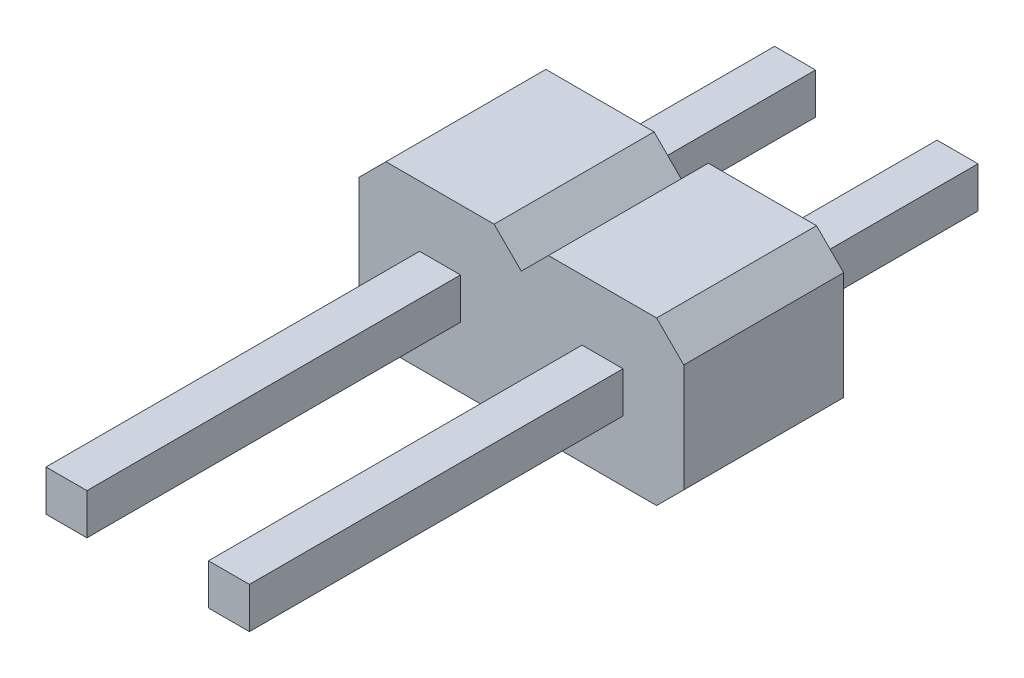
ISO-10303-21;
HEADER;
FILE_DESCRIPTION(('STEP AP214'),'2;1');
FILE_NAME('part.step','',(''),(''),'','','');
FILE_SCHEMA(('AUTOMOTIVE_DESIGN { 1 0 10303 214 1 1 1 1 }'));
ENDSEC;
DATA;
#1=APPLICATION_CONTEXT('core data for automotive mechanical design processes');
#2=APPLICATION_PROTOCOL_DEFINITION('international standard','automotive_design',2000,#1);
#3=PRODUCT_CONTEXT('',#1,'mechanical');
#4=PRODUCT('Part','Part','',(#3));
#5=PRODUCT_RELATED_PRODUCT_CATEGORY('part','',(#4));
#6=PRODUCT_DEFINITION_FORMATION('','',#4);
#7=PRODUCT_DEFINITION_CONTEXT('part definition',#1,'design');
#8=PRODUCT_DEFINITION('design','',#6,#7);
#9=PRODUCT_DEFINITION_SHAPE('','',#8);
#10=(LENGTH_UNIT() NAMED_UNIT(*) SI_UNIT(.MILLI.,.METRE.));
#11=(NAMED_UNIT(*) PLANE_ANGLE_UNIT() SI_UNIT($,.RADIAN.));
#12=(NAMED_UNIT(*) SI_UNIT($,.STERADIAN.) SOLID_ANGLE_UNIT());
#13=UNCERTAINTY_MEASURE_WITH_UNIT(LENGTH_MEASURE(1.E-05),#10,'distance_accuracy_value','');
#14=(GEOMETRIC_REPRESENTATION_CONTEXT(3) GLOBAL_UNCERTAINTY_ASSIGNED_CONTEXT((#13)) GLOBAL_UNIT_ASSIGNED_CONTEXT((#10,
#11,#12)) REPRESENTATION_CONTEXT('',''));
#15=CARTESIAN_POINT('',(0.,0.,0.));
#16=DIRECTION('',(0.,0.,1.));
#17=DIRECTION('',(1.,0.,0.));
#18=AXIS2_PLACEMENT_3D('',#15,#16,#17);
#19=CARTESIAN_POINT('',(0.,0.,2.5));
#20=DIRECTION('',(0.,0.,-1.));
#21=DIRECTION('',(-1.,0.,0.));
#22=AXIS2_PLACEMENT_3D('',#19,#20,#21);
#23=PLANE('',#22);
#24=DIRECTION('',(0.,-1.,0.));
#25=VECTOR('',#24,1.);
#26=CARTESIAN_POINT('',(-0.32,0.32,2.5));
#27=LINE('',#26,#25);
#28=CARTESIAN_POINT('',(-0.32,0.32,2.5));
#29=VERTEX_POINT('',#28);
#30=CARTESIAN_POINT('',(-0.32,-0.32,2.5));
#31=VERTEX_POINT('',#30);
#32=EDGE_CURVE('E335',#29,#31,#27,.T.);
#33=ORIENTED_EDGE('',*,*,#32,.F.);
#34=DIRECTION('',(-1.,0.,0.));
#35=VECTOR('',#34,1.);
#36=CARTESIAN_POINT('',(-0.32,0.32,2.5));
#37=LINE('',#36,#35);
#38=CARTESIAN_POINT('',(0.32,0.32,2.5));
#39=VERTEX_POINT('',#38);
#40=EDGE_CURVE('E340',#39,#29,#37,.T.);
#41=ORIENTED_EDGE('',*,*,#40,.F.);
#42=DIRECTION('',(0.,1.,0.));
#43=VECTOR('',#42,1.);
#44=CARTESIAN_POINT('',(0.32,0.32,2.5));
#45=LINE('',#44,#43);
#46=CARTESIAN_POINT('',(0.32,-0.32,2.5));
#47=VERTEX_POINT('',#46);
#48=EDGE_CURVE('E352',#47,#39,#45,.T.);
#49=ORIENTED_EDGE('',*,*,#48,.F.);
#50=DIRECTION('',(1.,0.,0.));
#51=VECTOR('',#50,1.);
#52=CARTESIAN_POINT('',(-0.32,-0.32,2.5));
#53=LINE('',#52,#51);
#54=EDGE_CURVE('E349',#31,#47,#53,.T.);
#55=ORIENTED_EDGE('',*,*,#54,.F.);
#56=EDGE_LOOP('',(#33,#41,#49,#55));
#57=FACE_BOUND('',#56,.T.);
#58=DIRECTION('',(1.,0.,0.));
#59=VECTOR('',#58,1.);
#60=CARTESIAN_POINT('',(-0.845735931288072,-1.27,2.5));
#61=LINE('',#60,#59);
#62=CARTESIAN_POINT('',(-0.845735931288072,-1.27,2.5));
#63=VERTEX_POINT('',#62);
#64=CARTESIAN_POINT('',(0.845735931288072,-1.27,2.5));
#65=VERTEX_POINT('',#64);
#66=EDGE_CURVE('E398',#63,#65,#61,.T.);
#67=ORIENTED_EDGE('',*,*,#66,.T.);
#68=DIRECTION('',(0.707106781186547,0.707106781186548,0.));
#69=VECTOR('',#68,1.);
#70=CARTESIAN_POINT('',(0.845735931288072,-1.27,2.5));
#71=LINE('',#70,#69);
#72=CARTESIAN_POINT('',(1.27,-0.845735931288072,2.5));
#73=VERTEX_POINT('',#72);
#74=EDGE_CURVE('E401',#65,#73,#71,.T.);
#75=ORIENTED_EDGE('',*,*,#74,.T.);
#76=DIRECTION('',(0.707106781186548,-0.707106781186548,0.));
#77=VECTOR('',#76,1.);
#78=CARTESIAN_POINT('',(1.27,-0.845735931288072,2.5));
#79=LINE('',#78,#77);
#80=CARTESIAN_POINT('',(1.69426406871193,-1.27,2.5));
#81=VERTEX_POINT('',#80);
#82=EDGE_CURVE('E301',#73,#81,#79,.T.);
#83=ORIENTED_EDGE('',*,*,#82,.T.);
#84=DIRECTION('',(1.,0.,0.));
#85=VECTOR('',#84,1.);
#86=CARTESIAN_POINT('',(1.69426406871193,-1.27,2.5));
#87=LINE('',#86,#85);
#88=CARTESIAN_POINT('',(3.38573593128807,-1.27,2.5));
#89=VERTEX_POINT('',#88);
#90=EDGE_CURVE('E286',#81,#89,#87,.T.);
#91=ORIENTED_EDGE('',*,*,#90,.T.);
#92=DIRECTION('',(0.707106781186547,0.707106781186548,0.));
#93=VECTOR('',#92,1.);
#94=CARTESIAN_POINT('',(3.38573593128807,-1.27,2.5));
#95=LINE('',#94,#93);
#96=CARTESIAN_POINT('',(3.81,-0.845735931288072,2.5));
#97=VERTEX_POINT('',#96);
#98=EDGE_CURVE('E289',#89,#97,#95,.T.);
#99=ORIENTED_EDGE('',*,*,#98,.T.);
#100=DIRECTION('',(0.,1.,0.));
#101=VECTOR('',#100,1.);
#102=CARTESIAN_POINT('',(3.81,0.845735931288072,2.5));
#103=LINE('',#102,#101);
#104=CARTESIAN_POINT('',(3.81,0.845735931288072,2.5));
#105=VERTEX_POINT('',#104);
#106=EDGE_CURVE('E292',#97,#105,#103,.T.);
#107=ORIENTED_EDGE('',*,*,#106,.T.);
#108=DIRECTION('',(-0.707106781186547,0.707106781186548,0.));
#109=VECTOR('',#108,1.);
#110=CARTESIAN_POINT('',(3.81,0.845735931288072,2.5));
#111=LINE('',#110,#109);
#112=CARTESIAN_POINT('',(3.38573593128807,1.27,2.5));
#113=VERTEX_POINT('',#112);
#114=EDGE_CURVE('E294',#105,#113,#111,.T.);
#115=ORIENTED_EDGE('',*,*,#114,.T.);
#116=DIRECTION('',(-1.,0.,0.));
#117=VECTOR('',#116,1.);
#118=CARTESIAN_POINT('',(1.69426406871193,1.27,2.5));
#119=LINE('',#118,#117);
#120=CARTESIAN_POINT('',(1.69426406871193,1.27,2.5));
#121=VERTEX_POINT('',#120);
#122=EDGE_CURVE('E296',#113,#121,#119,.T.);
#123=ORIENTED_EDGE('',*,*,#122,.T.);
#124=DIRECTION('',(-0.707106781186547,-0.707106781186548,0.));
#125=VECTOR('',#124,1.);
#126=CARTESIAN_POINT('',(1.69426406871193,1.27,2.5));
#127=LINE('',#126,#125);
#128=CARTESIAN_POINT('',(1.27,0.845735931288072,2.5));
#129=VERTEX_POINT('',#128);
#130=EDGE_CURVE('E298',#121,#129,#127,.T.);
#131=ORIENTED_EDGE('',*,*,#130,.T.);
#132=DIRECTION('',(-0.707106781186547,0.707106781186548,0.));
#133=VECTOR('',#132,1.);
#134=CARTESIAN_POINT('',(1.27,0.845735931288072,2.5));
#135=LINE('',#134,#133);
#136=CARTESIAN_POINT('',(0.845735931288072,1.27,2.5));
#137=VERTEX_POINT('',#136);
#138=EDGE_CURVE('E404',#129,#137,#135,.T.);
#139=ORIENTED_EDGE('',*,*,#138,.T.);
#140=DIRECTION('',(-1.,0.,0.));
#141=VECTOR('',#140,1.);
#142=CARTESIAN_POINT('',(-0.845735931288072,1.27,2.5));
#143=LINE('',#142,#141);
#144=CARTESIAN_POINT('',(-0.845735931288072,1.27,2.5));
#145=VERTEX_POINT('',#144);
#146=EDGE_CURVE('E406',#137,#145,#143,.T.);
#147=ORIENTED_EDGE('',*,*,#146,.T.);
#148=DIRECTION('',(-0.707106781186547,-0.707106781186548,0.));
#149=VECTOR('',#148,1.);
#150=CARTESIAN_POINT('',(-0.845735931288072,1.27,2.5));
#151=LINE('',#150,#149);
#152=CARTESIAN_POINT('',(-1.27,0.845735931288072,2.5));
#153=VERTEX_POINT('',#152);
#154=EDGE_CURVE('E408',#145,#153,#151,.T.);
#155=ORIENTED_EDGE('',*,*,#154,.T.);
#156=DIRECTION('',(0.,-1.,0.));
#157=VECTOR('',#156,1.);
#158=CARTESIAN_POINT('',(-1.27,0.845735931288072,2.5));
#159=LINE('',#158,#157);
#160=CARTESIAN_POINT('',(-1.27,-0.845735931288072,2.5));
#161=VERTEX_POINT('',#160);
#162=EDGE_CURVE('E410',#153,#161,#159,.T.);
#163=ORIENTED_EDGE('',*,*,#162,.T.);
#164=DIRECTION('',(0.707106781186548,-0.707106781186548,0.));
#165=VECTOR('',#164,1.);
#166=CARTESIAN_POINT('',(-1.27,-0.845735931288072,2.5));
#167=LINE('',#166,#165);
#168=EDGE_CURVE('E412',#161,#63,#167,.T.);
#169=ORIENTED_EDGE('',*,*,#168,.T.);
#170=EDGE_LOOP('',(#67,#75,#83,#91,#99,#107,#115,#123,#131,#139,#147,#155,#163,#169));
#171=FACE_BOUND('',#170,.T.);
#172=DIRECTION('',(0.,-1.,0.));
#173=VECTOR('',#172,1.);
#174=CARTESIAN_POINT('',(2.22,0.32,2.5));
#175=LINE('',#174,#173);
#176=CARTESIAN_POINT('',(2.22,0.32,2.5));
#177=VERTEX_POINT('',#176);
#178=CARTESIAN_POINT('',(2.22,-0.32,2.5));
#179=VERTEX_POINT('',#178);
#180=EDGE_CURVE('E250',#177,#179,#175,.T.);
#181=ORIENTED_EDGE('',*,*,#180,.F.);
#182=DIRECTION('',(-1.,0.,0.));
#183=VECTOR('',#182,1.);
#184=CARTESIAN_POINT('',(2.22,0.32,2.5));
#185=LINE('',#184,#183);
#186=CARTESIAN_POINT('',(2.86,0.32,2.5));
#187=VERTEX_POINT('',#186);
#188=EDGE_CURVE('E247',#187,#177,#185,.T.);
#189=ORIENTED_EDGE('',*,*,#188,.F.);
#190=DIRECTION('',(0.,1.,0.));
#191=VECTOR('',#190,1.);
#192=CARTESIAN_POINT('',(2.86,0.32,2.5));
#193=LINE('',#192,#191);
#194=CARTESIAN_POINT('',(2.86,-0.32,2.5));
#195=VERTEX_POINT('',#194);
#196=EDGE_CURVE('E53',#195,#187,#193,.T.);
#197=ORIENTED_EDGE('',*,*,#196,.F.);
#198=DIRECTION('',(1.,0.,0.));
#199=VECTOR('',#198,1.);
#200=CARTESIAN_POINT('',(2.22,-0.32,2.5));
#201=LINE('',#200,#199);
#202=EDGE_CURVE('E48',#179,#195,#201,.T.);
#203=ORIENTED_EDGE('',*,*,#202,.F.);
#204=EDGE_LOOP('',(#181,#189,#197,#203));
#205=FACE_BOUND('',#204,.T.);
#206=ADVANCED_FACE('F33',(#57,#171,#205),#23,.F.);
#207=CARTESIAN_POINT('',(0.,0.,0.));
#208=DIRECTION('',(0.,0.,-1.));
#209=DIRECTION('',(-1.,0.,0.));
#210=AXIS2_PLACEMENT_3D('',#207,#208,#209);
#211=PLANE('',#210);
#212=DIRECTION('',(1.,0.,0.));
#213=VECTOR('',#212,1.);
#214=CARTESIAN_POINT('',(-0.32,0.32,0.));
#215=LINE('',#214,#213);
#216=CARTESIAN_POINT('',(-0.32,0.32,0.));
#217=VERTEX_POINT('',#216);
#218=CARTESIAN_POINT('',(0.32,0.32,0.));
#219=VERTEX_POINT('',#218);
#220=EDGE_CURVE('E382',#217,#219,#215,.T.);
#221=ORIENTED_EDGE('',*,*,#220,.F.);
#222=DIRECTION('',(0.,1.,0.));
#223=VECTOR('',#222,1.);
#224=CARTESIAN_POINT('',(-0.32,0.32,0.));
#225=LINE('',#224,#223);
#226=CARTESIAN_POINT('',(-0.32,-0.32,0.));
#227=VERTEX_POINT('',#226);
#228=EDGE_CURVE('E368',#227,#217,#225,.T.);
#229=ORIENTED_EDGE('',*,*,#228,.F.);
#230=DIRECTION('',(-1.,0.,0.));
#231=VECTOR('',#230,1.);
#232=CARTESIAN_POINT('',(-0.32,-0.32,0.));
#233=LINE('',#232,#231);
#234=CARTESIAN_POINT('',(0.32,-0.32,0.));
#235=VERTEX_POINT('',#234);
#236=EDGE_CURVE('E373',#235,#227,#233,.T.);
#237=ORIENTED_EDGE('',*,*,#236,.F.);
#238=DIRECTION('',(0.,-1.,0.));
#239=VECTOR('',#238,1.);
#240=CARTESIAN_POINT('',(0.32,0.32,0.));
#241=LINE('',#240,#239);
#242=EDGE_CURVE('E384',#219,#235,#241,.T.);
#243=ORIENTED_EDGE('',*,*,#242,.F.);
#244=EDGE_LOOP('',(#221,#229,#237,#243));
#245=FACE_BOUND('',#244,.T.);
#246=DIRECTION('',(1.,0.,0.));
#247=VECTOR('',#246,1.);
#248=CARTESIAN_POINT('',(-0.845735931288072,-1.27,0.));
#249=LINE('',#248,#247);
#250=CARTESIAN_POINT('',(-0.845735931288072,-1.27,0.));
#251=VERTEX_POINT('',#250);
#252=CARTESIAN_POINT('',(0.845735931288072,-1.27,0.));
#253=VERTEX_POINT('',#252);
#254=EDGE_CURVE('E397',#251,#253,#249,.T.);
#255=ORIENTED_EDGE('',*,*,#254,.F.);
#256=DIRECTION('',(0.707106781186548,-0.707106781186548,0.));
#257=VECTOR('',#256,1.);
#258=CARTESIAN_POINT('',(-1.27,-0.845735931288072,0.));
#259=LINE('',#258,#257);
#260=CARTESIAN_POINT('',(-1.27,-0.845735931288072,0.));
#261=VERTEX_POINT('',#260);
#262=EDGE_CURVE('E402',#261,#251,#259,.T.);
#263=ORIENTED_EDGE('',*,*,#262,.F.);
#264=DIRECTION('',(0.,-1.,0.));
#265=VECTOR('',#264,1.);
#266=CARTESIAN_POINT('',(-1.27,0.845735931288072,0.));
#267=LINE('',#266,#265);
#268=CARTESIAN_POINT('',(-1.27,0.845735931288072,0.));
#269=VERTEX_POINT('',#268);
#270=EDGE_CURVE('E425',#269,#261,#267,.T.);
#271=ORIENTED_EDGE('',*,*,#270,.F.);
#272=DIRECTION('',(-0.707106781186547,-0.707106781186548,0.));
#273=VECTOR('',#272,1.);
#274=CARTESIAN_POINT('',(-0.845735931288072,1.27,0.));
#275=LINE('',#274,#273);
#276=CARTESIAN_POINT('',(-0.845735931288072,1.27,0.));
#277=VERTEX_POINT('',#276);
#278=EDGE_CURVE('E423',#277,#269,#275,.T.);
#279=ORIENTED_EDGE('',*,*,#278,.F.);
#280=DIRECTION('',(-1.,0.,0.));
#281=VECTOR('',#280,1.);
#282=CARTESIAN_POINT('',(-0.845735931288072,1.27,0.));
#283=LINE('',#282,#281);
#284=CARTESIAN_POINT('',(0.845735931288072,1.27,0.));
#285=VERTEX_POINT('',#284);
#286=EDGE_CURVE('E421',#285,#277,#283,.T.);
#287=ORIENTED_EDGE('',*,*,#286,.F.);
#288=DIRECTION('',(-0.707106781186547,0.707106781186548,0.));
#289=VECTOR('',#288,1.);
#290=CARTESIAN_POINT('',(1.27,0.845735931288072,0.));
#291=LINE('',#290,#289);
#292=CARTESIAN_POINT('',(1.27,0.845735931288072,0.));
#293=VERTEX_POINT('',#292);
#294=EDGE_CURVE('E419',#293,#285,#291,.T.);
#295=ORIENTED_EDGE('',*,*,#294,.F.);
#296=DIRECTION('',(-0.707106781186547,-0.707106781186548,0.));
#297=VECTOR('',#296,1.);
#298=CARTESIAN_POINT('',(1.69426406871193,1.27,0.));
#299=LINE('',#298,#297);
#300=CARTESIAN_POINT('',(1.69426406871193,1.27,0.));
#301=VERTEX_POINT('',#300);
#302=EDGE_CURVE('E314',#301,#293,#299,.T.);
#303=ORIENTED_EDGE('',*,*,#302,.F.);
#304=DIRECTION('',(-1.,0.,0.));
#305=VECTOR('',#304,1.);
#306=CARTESIAN_POINT('',(1.69426406871193,1.27,0.));
#307=LINE('',#306,#305);
#308=CARTESIAN_POINT('',(3.38573593128807,1.27,0.));
#309=VERTEX_POINT('',#308);
#310=EDGE_CURVE('E312',#309,#301,#307,.T.);
#311=ORIENTED_EDGE('',*,*,#310,.F.);
#312=DIRECTION('',(-0.707106781186547,0.707106781186548,0.));
#313=VECTOR('',#312,1.);
#314=CARTESIAN_POINT('',(3.81,0.845735931288072,0.));
#315=LINE('',#314,#313);
#316=CARTESIAN_POINT('',(3.81,0.845735931288072,0.));
#317=VERTEX_POINT('',#316);
#318=EDGE_CURVE('E310',#317,#309,#315,.T.);
#319=ORIENTED_EDGE('',*,*,#318,.F.);
#320=DIRECTION('',(0.,1.,0.));
#321=VECTOR('',#320,1.);
#322=CARTESIAN_POINT('',(3.81,0.845735931288072,0.));
#323=LINE('',#322,#321);
#324=CARTESIAN_POINT('',(3.81,-0.845735931288072,0.));
#325=VERTEX_POINT('',#324);
#326=EDGE_CURVE('E308',#325,#317,#323,.T.);
#327=ORIENTED_EDGE('',*,*,#326,.F.);
#328=DIRECTION('',(0.707106781186547,0.707106781186548,0.));
#329=VECTOR('',#328,1.);
#330=CARTESIAN_POINT('',(3.38573593128807,-1.27,0.));
#331=LINE('',#330,#329);
#332=CARTESIAN_POINT('',(3.38573593128807,-1.27,0.));
#333=VERTEX_POINT('',#332);
#334=EDGE_CURVE('E306',#333,#325,#331,.T.);
#335=ORIENTED_EDGE('',*,*,#334,.F.);
#336=DIRECTION('',(1.,0.,0.));
#337=VECTOR('',#336,1.);
#338=CARTESIAN_POINT('',(1.69426406871193,-1.27,0.));
#339=LINE('',#338,#337);
#340=CARTESIAN_POINT('',(1.69426406871193,-1.27,0.));
#341=VERTEX_POINT('',#340);
#342=EDGE_CURVE('E285',#341,#333,#339,.T.);
#343=ORIENTED_EDGE('',*,*,#342,.F.);
#344=DIRECTION('',(0.707106781186548,-0.707106781186548,0.));
#345=VECTOR('',#344,1.);
#346=CARTESIAN_POINT('',(1.27,-0.845735931288072,0.));
#347=LINE('',#346,#345);
#348=CARTESIAN_POINT('',(1.27,-0.845735931288072,0.));
#349=VERTEX_POINT('',#348);
#350=EDGE_CURVE('E290',#349,#341,#347,.T.);
#351=ORIENTED_EDGE('',*,*,#350,.F.);
#352=DIRECTION('',(0.707106781186547,0.707106781186548,0.));
#353=VECTOR('',#352,1.);
#354=CARTESIAN_POINT('',(0.845735931288072,-1.27,0.));
#355=LINE('',#354,#353);
#356=EDGE_CURVE('E417',#253,#349,#355,.T.);
#357=ORIENTED_EDGE('',*,*,#356,.F.);
#358=EDGE_LOOP('',(#255,#263,#271,#279,#287,#295,#303,#311,#319,#327,#335,#343,#351,#357));
#359=FACE_BOUND('',#358,.T.);
#360=DIRECTION('',(1.,0.,0.));
#361=VECTOR('',#360,1.);
#362=CARTESIAN_POINT('',(2.22,0.32,0.));
#363=LINE('',#362,#361);
#364=CARTESIAN_POINT('',(2.22,0.32,0.));
#365=VERTEX_POINT('',#364);
#366=CARTESIAN_POINT('',(2.86,0.32,0.));
#367=VERTEX_POINT('',#366);
#368=EDGE_CURVE('E277',#365,#367,#363,.T.);
#369=ORIENTED_EDGE('',*,*,#368,.F.);
#370=DIRECTION('',(0.,1.,0.));
#371=VECTOR('',#370,1.);
#372=CARTESIAN_POINT('',(2.22,0.32,0.));
#373=LINE('',#372,#371);
#374=CARTESIAN_POINT('',(2.22,-0.32,0.));
#375=VERTEX_POINT('',#374);
#376=EDGE_CURVE('E282',#375,#365,#373,.T.);
#377=ORIENTED_EDGE('',*,*,#376,.F.);
#378=DIRECTION('',(-1.,0.,0.));
#379=VECTOR('',#378,1.);
#380=CARTESIAN_POINT('',(2.22,-0.32,0.));
#381=LINE('',#380,#379);
#382=CARTESIAN_POINT('',(2.86,-0.32,0.));
#383=VERTEX_POINT('',#382);
#384=EDGE_CURVE('E251',#383,#375,#381,.T.);
#385=ORIENTED_EDGE('',*,*,#384,.F.);
#386=DIRECTION('',(0.,-1.,0.));
#387=VECTOR('',#386,1.);
#388=CARTESIAN_POINT('',(2.86,0.32,0.));
#389=LINE('',#388,#387);
#390=EDGE_CURVE('E273',#367,#383,#389,.T.);
#391=ORIENTED_EDGE('',*,*,#390,.F.);
#392=EDGE_LOOP('',(#369,#377,#385,#391));
#393=FACE_BOUND('',#392,.T.);
#394=ADVANCED_FACE('F454',(#245,#359,#393),#211,.T.);
#395=CARTESIAN_POINT('',(-0.845735931288072,-1.27,2.5));
#396=DIRECTION('',(0.,1.,0.));
#397=DIRECTION('',(0.,0.,1.));
#398=AXIS2_PLACEMENT_3D('',#395,#396,#397);
#399=PLANE('',#398);
#400=ORIENTED_EDGE('',*,*,#254,.T.);
#401=DIRECTION('',(0.,0.,-1.));
#402=VECTOR('',#401,1.);
#403=CARTESIAN_POINT('',(0.845735931288072,-1.27,2.5));
#404=LINE('',#403,#402);
#405=EDGE_CURVE('E11',#65,#253,#404,.T.);
#406=ORIENTED_EDGE('',*,*,#405,.F.);
#407=ORIENTED_EDGE('',*,*,#66,.F.);
#408=DIRECTION('',(0.,0.,-1.));
#409=VECTOR('',#408,1.);
#410=CARTESIAN_POINT('',(-0.845735931288072,-1.27,2.5));
#411=LINE('',#410,#409);
#412=EDGE_CURVE('E414',#63,#251,#411,.T.);
#413=ORIENTED_EDGE('',*,*,#412,.T.);
#414=EDGE_LOOP('',(#400,#406,#407,#413));
#415=FACE_BOUND('',#414,.T.);
#416=ADVANCED_FACE('F35',(#415),#399,.F.);
#417=CARTESIAN_POINT('',(0.845735931288072,-1.27,2.5));
#418=DIRECTION('',(-0.707106781186548,0.707106781186547,0.));
#419=DIRECTION('',(-0.707106781186547,-0.707106781186548,0.));
#420=AXIS2_PLACEMENT_3D('',#417,#418,#419);
#421=PLANE('',#420);
#422=ORIENTED_EDGE('',*,*,#356,.T.);
#423=DIRECTION('',(0.,0.,-1.));
#424=VECTOR('',#423,1.);
#425=CARTESIAN_POINT('',(1.27,-0.845735931288072,2.5));
#426=LINE('',#425,#424);
#427=EDGE_CURVE('E41',#73,#349,#426,.T.);
#428=ORIENTED_EDGE('',*,*,#427,.F.);
#429=ORIENTED_EDGE('',*,*,#74,.F.);
#430=ORIENTED_EDGE('',*,*,#405,.T.);
#431=EDGE_LOOP('',(#422,#428,#429,#430));
#432=FACE_BOUND('',#431,.T.);
#433=ADVANCED_FACE('F465',(#432),#421,.F.);
#434=CARTESIAN_POINT('',(1.27,0.845735931288072,2.5));
#435=DIRECTION('',(-0.707106781186548,-0.707106781186547,0.));
#436=DIRECTION('',(0.707106781186547,-0.707106781186548,0.));
#437=AXIS2_PLACEMENT_3D('',#434,#435,#436);
#438=PLANE('',#437);
#439=ORIENTED_EDGE('',*,*,#294,.T.);
#440=DIRECTION('',(0.,0.,-1.));
#441=VECTOR('',#440,1.);
#442=CARTESIAN_POINT('',(0.845735931288072,1.27,2.5));
#443=LINE('',#442,#441);
#444=EDGE_CURVE('E439',#137,#285,#443,.T.);
#445=ORIENTED_EDGE('',*,*,#444,.F.);
#446=ORIENTED_EDGE('',*,*,#138,.F.);
#447=DIRECTION('',(0.,0.,-1.));
#448=VECTOR('',#447,1.);
#449=CARTESIAN_POINT('',(1.27,0.845735931288072,2.5));
#450=LINE('',#449,#448);
#451=EDGE_CURVE('E442',#129,#293,#450,.T.);
#452=ORIENTED_EDGE('',*,*,#451,.T.);
#453=EDGE_LOOP('',(#439,#445,#446,#452));
#454=FACE_BOUND('',#453,.T.);
#455=ADVANCED_FACE('F491',(#454),#438,.F.);
#456=CARTESIAN_POINT('',(-0.845735931288072,1.27,2.5));
#457=DIRECTION('',(0.,-1.,0.));
#458=DIRECTION('',(0.,0.,-1.));
#459=AXIS2_PLACEMENT_3D('',#456,#457,#458);
#460=PLANE('',#459);
#461=ORIENTED_EDGE('',*,*,#286,.T.);
#462=DIRECTION('',(0.,0.,-1.));
#463=VECTOR('',#462,1.);
#464=CARTESIAN_POINT('',(-0.845735931288072,1.27,2.5));
#465=LINE('',#464,#463);
#466=EDGE_CURVE('E436',#145,#277,#465,.T.);
#467=ORIENTED_EDGE('',*,*,#466,.F.);
#468=ORIENTED_EDGE('',*,*,#146,.F.);
#469=ORIENTED_EDGE('',*,*,#444,.T.);
#470=EDGE_LOOP('',(#461,#467,#468,#469));
#471=FACE_BOUND('',#470,.T.);
#472=ADVANCED_FACE('F487',(#471),#460,.F.);
#473=CARTESIAN_POINT('',(-0.845735931288072,1.27,2.5));
#474=DIRECTION('',(0.707106781186548,-0.707106781186547,0.));
#475=DIRECTION('',(0.707106781186547,0.707106781186548,0.));
#476=AXIS2_PLACEMENT_3D('',#473,#474,#475);
#477=PLANE('',#476);
#478=ORIENTED_EDGE('',*,*,#278,.T.);
#479=DIRECTION('',(0.,0.,-1.));
#480=VECTOR('',#479,1.);
#481=CARTESIAN_POINT('',(-1.27,0.845735931288072,2.5));
#482=LINE('',#481,#480);
#483=EDGE_CURVE('E433',#153,#269,#482,.T.);
#484=ORIENTED_EDGE('',*,*,#483,.F.);
#485=ORIENTED_EDGE('',*,*,#154,.F.);
#486=ORIENTED_EDGE('',*,*,#466,.T.);
#487=EDGE_LOOP('',(#478,#484,#485,#486));
#488=FACE_BOUND('',#487,.T.);
#489=ADVANCED_FACE('F481',(#488),#477,.F.);
#490=CARTESIAN_POINT('',(-1.27,0.845735931288072,2.5));
#491=DIRECTION('',(1.,0.,0.));
#492=DIRECTION('',(0.,0.,-1.));
#493=AXIS2_PLACEMENT_3D('',#490,#491,#492);
#494=PLANE('',#493);
#495=ORIENTED_EDGE('',*,*,#270,.T.);
#496=DIRECTION('',(0.,0.,-1.));
#497=VECTOR('',#496,1.);
#498=CARTESIAN_POINT('',(-1.27,-0.845735931288072,2.5));
#499=LINE('',#498,#497);
#500=EDGE_CURVE('E430',#161,#261,#499,.T.);
#501=ORIENTED_EDGE('',*,*,#500,.F.);
#502=ORIENTED_EDGE('',*,*,#162,.F.);
#503=ORIENTED_EDGE('',*,*,#483,.T.);
#504=EDGE_LOOP('',(#495,#501,#502,#503));
#505=FACE_BOUND('',#504,.T.);
#506=ADVANCED_FACE('F477',(#505),#494,.F.);
#507=CARTESIAN_POINT('',(-1.27,-0.845735931288072,2.5));
#508=DIRECTION('',(0.707106781186548,0.707106781186548,0.));
#509=DIRECTION('',(-0.707106781186548,0.707106781186548,0.));
#510=AXIS2_PLACEMENT_3D('',#507,#508,#509);
#511=PLANE('',#510);
#512=ORIENTED_EDGE('',*,*,#262,.T.);
#513=ORIENTED_EDGE('',*,*,#412,.F.);
#514=ORIENTED_EDGE('',*,*,#168,.F.);
#515=ORIENTED_EDGE('',*,*,#500,.T.);
#516=EDGE_LOOP('',(#512,#513,#514,#515));
#517=FACE_BOUND('',#516,.T.);
#518=ADVANCED_FACE('F472',(#517),#511,.F.);
#519=CARTESIAN_POINT('',(-0.32,0.32,-3.05));
#520=DIRECTION('',(1.,0.,0.));
#521=DIRECTION('',(0.,0.,-1.));
#522=AXIS2_PLACEMENT_3D('',#519,#520,#521);
#523=PLANE('',#522);
#524=ORIENTED_EDGE('',*,*,#228,.T.);
#525=DIRECTION('',(0.,0.,1.));
#526=VECTOR('',#525,1.);
#527=CARTESIAN_POINT('',(-0.32,0.32,-3.05));
#528=LINE('',#527,#526);
#529=CARTESIAN_POINT('',(-0.32,0.32,-3.05));
#530=VERTEX_POINT('',#529);
#531=EDGE_CURVE('E395',#530,#217,#528,.T.);
#532=ORIENTED_EDGE('',*,*,#531,.F.);
#533=DIRECTION('',(0.,1.,0.));
#534=VECTOR('',#533,1.);
#535=CARTESIAN_POINT('',(-0.32,0.32,-3.05));
#536=LINE('',#535,#534);
#537=CARTESIAN_POINT('',(-0.32,-0.32,-3.05));
#538=VERTEX_POINT('',#537);
#539=EDGE_CURVE('E369',#538,#530,#536,.T.);
#540=ORIENTED_EDGE('',*,*,#539,.F.);
#541=DIRECTION('',(0.,0.,1.));
#542=VECTOR('',#541,1.);
#543=CARTESIAN_POINT('',(-0.32,-0.32,-3.05));
#544=LINE('',#543,#542);
#545=EDGE_CURVE('E379',#538,#227,#544,.T.);
#546=ORIENTED_EDGE('',*,*,#545,.T.);
#547=EDGE_LOOP('',(#524,#532,#540,#546));
#548=FACE_BOUND('',#547,.T.);
#549=ADVANCED_FACE('F530',(#548),#523,.F.);
#550=CARTESIAN_POINT('',(-0.32,0.32,-3.05));
#551=DIRECTION('',(0.,-1.,0.));
#552=DIRECTION('',(0.,0.,-1.));
#553=AXIS2_PLACEMENT_3D('',#550,#551,#552);
#554=PLANE('',#553);
#555=ORIENTED_EDGE('',*,*,#220,.T.);
#556=DIRECTION('',(0.,0.,1.));
#557=VECTOR('',#556,1.);
#558=CARTESIAN_POINT('',(0.32,0.32,-3.05));
#559=LINE('',#558,#557);
#560=CARTESIAN_POINT('',(0.32,0.32,-3.05));
#561=VERTEX_POINT('',#560);
#562=EDGE_CURVE('E392',#561,#219,#559,.T.);
#563=ORIENTED_EDGE('',*,*,#562,.F.);
#564=DIRECTION('',(1.,0.,0.));
#565=VECTOR('',#564,1.);
#566=CARTESIAN_POINT('',(-0.32,0.32,-3.05));
#567=LINE('',#566,#565);
#568=EDGE_CURVE('E372',#530,#561,#567,.T.);
#569=ORIENTED_EDGE('',*,*,#568,.F.);
#570=ORIENTED_EDGE('',*,*,#531,.T.);
#571=EDGE_LOOP('',(#555,#563,#569,#570));
#572=FACE_BOUND('',#571,.T.);
#573=ADVANCED_FACE('F802',(#572),#554,.F.);
#574=CARTESIAN_POINT('',(0.32,0.32,-3.05));
#575=DIRECTION('',(-1.,0.,0.));
#576=DIRECTION('',(0.,-1.,0.));
#577=AXIS2_PLACEMENT_3D('',#574,#575,#576);
#578=PLANE('',#577);
#579=ORIENTED_EDGE('',*,*,#242,.T.);
#580=DIRECTION('',(0.,0.,1.));
#581=VECTOR('',#580,1.);
#582=CARTESIAN_POINT('',(0.32,-0.32,-3.05));
#583=LINE('',#582,#581);
#584=CARTESIAN_POINT('',(0.32,-0.32,-3.05));
#585=VERTEX_POINT('',#584);
#586=EDGE_CURVE('E390',#585,#235,#583,.T.);
#587=ORIENTED_EDGE('',*,*,#586,.F.);
#588=DIRECTION('',(0.,-1.,0.));
#589=VECTOR('',#588,1.);
#590=CARTESIAN_POINT('',(0.32,0.32,-3.05));
#591=LINE('',#590,#589);
#592=EDGE_CURVE('E375',#561,#585,#591,.T.);
#593=ORIENTED_EDGE('',*,*,#592,.F.);
#594=ORIENTED_EDGE('',*,*,#562,.T.);
#595=EDGE_LOOP('',(#579,#587,#593,#594));
#596=FACE_BOUND('',#595,.T.);
#597=ADVANCED_FACE('F794',(#596),#578,.F.);
#598=CARTESIAN_POINT('',(-0.32,-0.32,-3.05));
#599=DIRECTION('',(0.,1.,0.));
#600=DIRECTION('',(0.,0.,1.));
#601=AXIS2_PLACEMENT_3D('',#598,#599,#600);
#602=PLANE('',#601);
#603=ORIENTED_EDGE('',*,*,#236,.T.);
#604=ORIENTED_EDGE('',*,*,#545,.F.);
#605=DIRECTION('',(-1.,0.,0.));
#606=VECTOR('',#605,1.);
#607=CARTESIAN_POINT('',(-0.32,-0.32,-3.05));
#608=LINE('',#607,#606);
#609=EDGE_CURVE('E377',#585,#538,#608,.T.);
#610=ORIENTED_EDGE('',*,*,#609,.F.);
#611=ORIENTED_EDGE('',*,*,#586,.T.);
#612=EDGE_LOOP('',(#603,#604,#610,#611));
#613=FACE_BOUND('',#612,.T.);
#614=ADVANCED_FACE('F786',(#613),#602,.F.);
#615=CARTESIAN_POINT('',(0.,0.,-3.05));
#616=DIRECTION('',(0.,0.,1.));
#617=DIRECTION('',(1.,0.,0.));
#618=AXIS2_PLACEMENT_3D('',#615,#616,#617);
#619=PLANE('',#618);
#620=ORIENTED_EDGE('',*,*,#539,.T.);
#621=ORIENTED_EDGE('',*,*,#568,.T.);
#622=ORIENTED_EDGE('',*,*,#592,.T.);
#623=ORIENTED_EDGE('',*,*,#609,.T.);
#624=EDGE_LOOP('',(#620,#621,#622,#623));
#625=FACE_BOUND('',#624,.T.);
#626=ADVANCED_FACE('F778',(#625),#619,.F.);
#627=CARTESIAN_POINT('',(-0.32,0.32,8.34));
#628=DIRECTION('',(1.,0.,0.));
#629=DIRECTION('',(0.,1.,0.));
#630=AXIS2_PLACEMENT_3D('',#627,#628,#629);
#631=PLANE('',#630);
#632=ORIENTED_EDGE('',*,*,#32,.T.);
#633=DIRECTION('',(0.,0.,-1.));
#634=VECTOR('',#633,1.);
#635=CARTESIAN_POINT('',(-0.32,-0.32,8.34));
#636=LINE('',#635,#634);
#637=CARTESIAN_POINT('',(-0.32,-0.32,8.34));
#638=VERTEX_POINT('',#637);
#639=EDGE_CURVE('E365',#638,#31,#636,.T.);
#640=ORIENTED_EDGE('',*,*,#639,.F.);
#641=DIRECTION('',(0.,-1.,0.));
#642=VECTOR('',#641,1.);
#643=CARTESIAN_POINT('',(-0.32,0.32,8.34));
#644=LINE('',#643,#642);
#645=CARTESIAN_POINT('',(-0.32,0.32,8.34));
#646=VERTEX_POINT('',#645);
#647=EDGE_CURVE('E336',#646,#638,#644,.T.);
#648=ORIENTED_EDGE('',*,*,#647,.F.);
#649=DIRECTION('',(0.,0.,-1.));
#650=VECTOR('',#649,1.);
#651=CARTESIAN_POINT('',(-0.32,0.32,8.34));
#652=LINE('',#651,#650);
#653=EDGE_CURVE('E346',#646,#29,#652,.T.);
#654=ORIENTED_EDGE('',*,*,#653,.T.);
#655=EDGE_LOOP('',(#632,#640,#648,#654));
#656=FACE_BOUND('',#655,.T.);
#657=ADVANCED_FACE('F770',(#656),#631,.F.);
#658=CARTESIAN_POINT('',(-0.32,-0.32,8.34));
#659=DIRECTION('',(0.,1.,0.));
#660=DIRECTION('',(0.,0.,1.));
#661=AXIS2_PLACEMENT_3D('',#658,#659,#660);
#662=PLANE('',#661);
#663=ORIENTED_EDGE('',*,*,#54,.T.);
#664=DIRECTION('',(0.,0.,-1.));
#665=VECTOR('',#664,1.);
#666=CARTESIAN_POINT('',(0.32,-0.32,8.34));
#667=LINE('',#666,#665);
#668=CARTESIAN_POINT('',(0.32,-0.32,8.34));
#669=VERTEX_POINT('',#668);
#670=EDGE_CURVE('E362',#669,#47,#667,.T.);
#671=ORIENTED_EDGE('',*,*,#670,.F.);
#672=DIRECTION('',(1.,0.,0.));
#673=VECTOR('',#672,1.);
#674=CARTESIAN_POINT('',(-0.32,-0.32,8.34));
#675=LINE('',#674,#673);
#676=EDGE_CURVE('E339',#638,#669,#675,.T.);
#677=ORIENTED_EDGE('',*,*,#676,.F.);
#678=ORIENTED_EDGE('',*,*,#639,.T.);
#679=EDGE_LOOP('',(#663,#671,#677,#678));
#680=FACE_BOUND('',#679,.T.);
#681=ADVANCED_FACE('F762',(#680),#662,.F.);
#682=CARTESIAN_POINT('',(0.32,0.32,8.34));
#683=DIRECTION('',(-1.,0.,0.));
#684=DIRECTION('',(0.,-1.,0.));
#685=AXIS2_PLACEMENT_3D('',#682,#683,#684);
#686=PLANE('',#685);
#687=ORIENTED_EDGE('',*,*,#48,.T.);
#688=DIRECTION('',(0.,0.,-1.));
#689=VECTOR('',#688,1.);
#690=CARTESIAN_POINT('',(0.32,0.32,8.34));
#691=LINE('',#690,#689);
#692=CARTESIAN_POINT('',(0.32,0.32,8.34));
#693=VERTEX_POINT('',#692);
#694=EDGE_CURVE('E359',#693,#39,#691,.T.);
#695=ORIENTED_EDGE('',*,*,#694,.F.);
#696=DIRECTION('',(0.,1.,0.));
#697=VECTOR('',#696,1.);
#698=CARTESIAN_POINT('',(0.32,0.32,8.34));
#699=LINE('',#698,#697);
#700=EDGE_CURVE('E342',#669,#693,#699,.T.);
#701=ORIENTED_EDGE('',*,*,#700,.F.);
#702=ORIENTED_EDGE('',*,*,#670,.T.);
#703=EDGE_LOOP('',(#687,#695,#701,#702));
#704=FACE_BOUND('',#703,.T.);
#705=ADVANCED_FACE('F754',(#704),#686,.F.);
#706=CARTESIAN_POINT('',(-0.32,0.32,8.34));
#707=DIRECTION('',(0.,-1.,0.));
#708=DIRECTION('',(0.,0.,-1.));
#709=AXIS2_PLACEMENT_3D('',#706,#707,#708);
#710=PLANE('',#709);
#711=ORIENTED_EDGE('',*,*,#40,.T.);
#712=ORIENTED_EDGE('',*,*,#653,.F.);
#713=DIRECTION('',(-1.,0.,0.));
#714=VECTOR('',#713,1.);
#715=CARTESIAN_POINT('',(-0.32,0.32,8.34));
#716=LINE('',#715,#714);
#717=EDGE_CURVE('E344',#693,#646,#716,.T.);
#718=ORIENTED_EDGE('',*,*,#717,.F.);
#719=ORIENTED_EDGE('',*,*,#694,.T.);
#720=EDGE_LOOP('',(#711,#712,#718,#719));
#721=FACE_BOUND('',#720,.T.);
#722=ADVANCED_FACE('F747',(#721),#710,.F.);
#723=CARTESIAN_POINT('',(0.,0.,8.34));
#724=DIRECTION('',(0.,0.,1.));
#725=DIRECTION('',(1.,0.,0.));
#726=AXIS2_PLACEMENT_3D('',#723,#724,#725);
#727=PLANE('',#726);
#728=ORIENTED_EDGE('',*,*,#647,.T.);
#729=ORIENTED_EDGE('',*,*,#676,.T.);
#730=ORIENTED_EDGE('',*,*,#700,.T.);
#731=ORIENTED_EDGE('',*,*,#717,.T.);
#732=EDGE_LOOP('',(#728,#729,#730,#731));
#733=FACE_BOUND('',#732,.T.);
#734=ADVANCED_FACE('F519',(#733),#727,.T.);
#735=CARTESIAN_POINT('',(1.69426406871193,-1.27,2.5));
#736=DIRECTION('',(0.,1.,0.));
#737=DIRECTION('',(0.,0.,1.));
#738=AXIS2_PLACEMENT_3D('',#735,#736,#737);
#739=PLANE('',#738);
#740=ORIENTED_EDGE('',*,*,#342,.T.);
#741=DIRECTION('',(0.,0.,-1.));
#742=VECTOR('',#741,1.);
#743=CARTESIAN_POINT('',(3.38573593128807,-1.27,2.5));
#744=LINE('',#743,#742);
#745=EDGE_CURVE('E332',#89,#333,#744,.T.);
#746=ORIENTED_EDGE('',*,*,#745,.F.);
#747=ORIENTED_EDGE('',*,*,#90,.F.);
#748=DIRECTION('',(0.,0.,-1.));
#749=VECTOR('',#748,1.);
#750=CARTESIAN_POINT('',(1.69426406871193,-1.27,2.5));
#751=LINE('',#750,#749);
#752=EDGE_CURVE('E303',#81,#341,#751,.T.);
#753=ORIENTED_EDGE('',*,*,#752,.T.);
#754=EDGE_LOOP('',(#740,#746,#747,#753));
#755=FACE_BOUND('',#754,.T.);
#756=ADVANCED_FACE('F459',(#755),#739,.F.);
#757=CARTESIAN_POINT('',(3.38573593128807,-1.27,2.5));
#758=DIRECTION('',(-0.707106781186548,0.707106781186547,0.));
#759=DIRECTION('',(-0.707106781186547,-0.707106781186548,0.));
#760=AXIS2_PLACEMENT_3D('',#757,#758,#759);
#761=PLANE('',#760);
#762=ORIENTED_EDGE('',*,*,#334,.T.);
#763=DIRECTION('',(0.,0.,-1.));
#764=VECTOR('',#763,1.);
#765=CARTESIAN_POINT('',(3.81,-0.845735931288072,2.5));
#766=LINE('',#765,#764);
#767=EDGE_CURVE('E329',#97,#325,#766,.T.);
#768=ORIENTED_EDGE('',*,*,#767,.F.);
#769=ORIENTED_EDGE('',*,*,#98,.F.);
#770=ORIENTED_EDGE('',*,*,#745,.T.);
#771=EDGE_LOOP('',(#762,#768,#769,#770));
#772=FACE_BOUND('',#771,.T.);
#773=ADVANCED_FACE('F511',(#772),#761,.F.);
#774=CARTESIAN_POINT('',(3.81,0.845735931288072,2.5));
#775=DIRECTION('',(-1.,0.,0.));
#776=DIRECTION('',(0.,0.,1.));
#777=AXIS2_PLACEMENT_3D('',#774,#775,#776);
#778=PLANE('',#777);
#779=ORIENTED_EDGE('',*,*,#326,.T.);
#780=DIRECTION('',(0.,0.,-1.));
#781=VECTOR('',#780,1.);
#782=CARTESIAN_POINT('',(3.81,0.845735931288072,2.5));
#783=LINE('',#782,#781);
#784=EDGE_CURVE('E326',#105,#317,#783,.T.);
#785=ORIENTED_EDGE('',*,*,#784,.F.);
#786=ORIENTED_EDGE('',*,*,#106,.F.);
#787=ORIENTED_EDGE('',*,*,#767,.T.);
#788=EDGE_LOOP('',(#779,#785,#786,#787));
#789=FACE_BOUND('',#788,.T.);
#790=ADVANCED_FACE('F509',(#789),#778,.F.);
#791=CARTESIAN_POINT('',(3.81,0.845735931288072,2.5));
#792=DIRECTION('',(-0.707106781186548,-0.707106781186547,0.));
#793=DIRECTION('',(0.707106781186547,-0.707106781186548,0.));
#794=AXIS2_PLACEMENT_3D('',#791,#792,#793);
#795=PLANE('',#794);
#796=ORIENTED_EDGE('',*,*,#318,.T.);
#797=DIRECTION('',(0.,0.,-1.));
#798=VECTOR('',#797,1.);
#799=CARTESIAN_POINT('',(3.38573593128807,1.27,2.5));
#800=LINE('',#799,#798);
#801=EDGE_CURVE('E323',#113,#309,#800,.T.);
#802=ORIENTED_EDGE('',*,*,#801,.F.);
#803=ORIENTED_EDGE('',*,*,#114,.F.);
#804=ORIENTED_EDGE('',*,*,#784,.T.);
#805=EDGE_LOOP('',(#796,#802,#803,#804));
#806=FACE_BOUND('',#805,.T.);
#807=ADVANCED_FACE('F505',(#806),#795,.F.);
#808=CARTESIAN_POINT('',(1.69426406871193,1.27,2.5));
#809=DIRECTION('',(0.,-1.,0.));
#810=DIRECTION('',(0.,0.,-1.));
#811=AXIS2_PLACEMENT_3D('',#808,#809,#810);
#812=PLANE('',#811);
#813=ORIENTED_EDGE('',*,*,#310,.T.);
#814=DIRECTION('',(0.,0.,-1.));
#815=VECTOR('',#814,1.);
#816=CARTESIAN_POINT('',(1.69426406871193,1.27,2.5));
#817=LINE('',#816,#815);
#818=EDGE_CURVE('E320',#121,#301,#817,.T.);
#819=ORIENTED_EDGE('',*,*,#818,.F.);
#820=ORIENTED_EDGE('',*,*,#122,.F.);
#821=ORIENTED_EDGE('',*,*,#801,.T.);
#822=EDGE_LOOP('',(#813,#819,#820,#821));
#823=FACE_BOUND('',#822,.T.);
#824=ADVANCED_FACE('F500',(#823),#812,.F.);
#825=CARTESIAN_POINT('',(1.69426406871193,1.27,2.5));
#826=DIRECTION('',(0.707106781186548,-0.707106781186547,0.));
#827=DIRECTION('',(0.707106781186547,0.707106781186548,0.));
#828=AXIS2_PLACEMENT_3D('',#825,#826,#827);
#829=PLANE('',#828);
#830=ORIENTED_EDGE('',*,*,#302,.T.);
#831=ORIENTED_EDGE('',*,*,#451,.F.);
#832=ORIENTED_EDGE('',*,*,#130,.F.);
#833=ORIENTED_EDGE('',*,*,#818,.T.);
#834=EDGE_LOOP('',(#830,#831,#832,#833));
#835=FACE_BOUND('',#834,.T.);
#836=ADVANCED_FACE('F495',(#835),#829,.F.);
#837=CARTESIAN_POINT('',(1.27,-0.845735931288072,2.5));
#838=DIRECTION('',(0.707106781186548,0.707106781186548,0.));
#839=DIRECTION('',(-0.707106781186548,0.707106781186548,0.));
#840=AXIS2_PLACEMENT_3D('',#837,#838,#839);
#841=PLANE('',#840);
#842=ORIENTED_EDGE('',*,*,#350,.T.);
#843=ORIENTED_EDGE('',*,*,#752,.F.);
#844=ORIENTED_EDGE('',*,*,#82,.F.);
#845=ORIENTED_EDGE('',*,*,#427,.T.);
#846=EDGE_LOOP('',(#842,#843,#844,#845));
#847=FACE_BOUND('',#846,.T.);
#848=ADVANCED_FACE('F448',(#847),#841,.F.);
#849=CARTESIAN_POINT('',(2.22,0.32,-3.05));
#850=DIRECTION('',(1.,0.,0.));
#851=DIRECTION('',(0.,0.,-1.));
#852=AXIS2_PLACEMENT_3D('',#849,#850,#851);
#853=PLANE('',#852);
#854=ORIENTED_EDGE('',*,*,#376,.T.);
#855=DIRECTION('',(0.,0.,1.));
#856=VECTOR('',#855,1.);
#857=CARTESIAN_POINT('',(2.22,0.32,-3.05));
#858=LINE('',#857,#856);
#859=CARTESIAN_POINT('',(2.22,0.32,-3.05));
#860=VERTEX_POINT('',#859);
#861=EDGE_CURVE('E280',#860,#365,#858,.T.);
#862=ORIENTED_EDGE('',*,*,#861,.F.);
#863=DIRECTION('',(0.,1.,0.));
#864=VECTOR('',#863,1.);
#865=CARTESIAN_POINT('',(2.22,0.32,-3.05));
#866=LINE('',#865,#864);
#867=CARTESIAN_POINT('',(2.22,-0.32,-3.05));
#868=VERTEX_POINT('',#867);
#869=EDGE_CURVE('E253',#868,#860,#866,.T.);
#870=ORIENTED_EDGE('',*,*,#869,.F.);
#871=DIRECTION('',(0.,0.,1.));
#872=VECTOR('',#871,1.);
#873=CARTESIAN_POINT('',(2.22,-0.32,-3.05));
#874=LINE('',#873,#872);
#875=EDGE_CURVE('E267',#868,#375,#874,.T.);
#876=ORIENTED_EDGE('',*,*,#875,.T.);
#877=EDGE_LOOP('',(#854,#862,#870,#876));
#878=FACE_BOUND('',#877,.T.);
#879=ADVANCED_FACE('F620',(#878),#853,.F.);
#880=CARTESIAN_POINT('',(2.22,0.32,-3.05));
#881=DIRECTION('',(0.,-1.,0.));
#882=DIRECTION('',(0.,0.,-1.));
#883=AXIS2_PLACEMENT_3D('',#880,#881,#882);
#884=PLANE('',#883);
#885=ORIENTED_EDGE('',*,*,#368,.T.);
#886=DIRECTION('',(0.,0.,1.));
#887=VECTOR('',#886,1.);
#888=CARTESIAN_POINT('',(2.86,0.32,-3.05));
#889=LINE('',#888,#887);
#890=CARTESIAN_POINT('',(2.86,0.32,-3.05));
#891=VERTEX_POINT('',#890);
#892=EDGE_CURVE('E275',#891,#367,#889,.T.);
#893=ORIENTED_EDGE('',*,*,#892,.F.);
#894=DIRECTION('',(1.,0.,0.));
#895=VECTOR('',#894,1.);
#896=CARTESIAN_POINT('',(2.22,0.32,-3.05));
#897=LINE('',#896,#895);
#898=EDGE_CURVE('E260',#860,#891,#897,.T.);
#899=ORIENTED_EDGE('',*,*,#898,.F.);
#900=ORIENTED_EDGE('',*,*,#861,.T.);
#901=EDGE_LOOP('',(#885,#893,#899,#900));
#902=FACE_BOUND('',#901,.T.);
#903=ADVANCED_FACE('F628',(#902),#884,.F.);
#904=CARTESIAN_POINT('',(2.86,0.32,-3.05));
#905=DIRECTION('',(-1.,0.,0.));
#906=DIRECTION('',(0.,-1.,0.));
#907=AXIS2_PLACEMENT_3D('',#904,#905,#906);
#908=PLANE('',#907);
#909=ORIENTED_EDGE('',*,*,#390,.T.);
#910=DIRECTION('',(0.,0.,1.));
#911=VECTOR('',#910,1.);
#912=CARTESIAN_POINT('',(2.86,-0.32,-3.05));
#913=LINE('',#912,#911);
#914=CARTESIAN_POINT('',(2.86,-0.32,-3.05));
#915=VERTEX_POINT('',#914);
#916=EDGE_CURVE('E270',#915,#383,#913,.T.);
#917=ORIENTED_EDGE('',*,*,#916,.F.);
#918=DIRECTION('',(0.,-1.,0.));
#919=VECTOR('',#918,1.);
#920=CARTESIAN_POINT('',(2.86,0.32,-3.05));
#921=LINE('',#920,#919);
#922=EDGE_CURVE('E262',#891,#915,#921,.T.);
#923=ORIENTED_EDGE('',*,*,#922,.F.);
#924=ORIENTED_EDGE('',*,*,#892,.T.);
#925=EDGE_LOOP('',(#909,#917,#923,#924));
#926=FACE_BOUND('',#925,.T.);
#927=ADVANCED_FACE('F638',(#926),#908,.F.);
#928=CARTESIAN_POINT('',(2.22,-0.32,-3.05));
#929=DIRECTION('',(0.,1.,0.));
#930=DIRECTION('',(0.,0.,1.));
#931=AXIS2_PLACEMENT_3D('',#928,#929,#930);
#932=PLANE('',#931);
#933=ORIENTED_EDGE('',*,*,#384,.T.);
#934=ORIENTED_EDGE('',*,*,#875,.F.);
#935=DIRECTION('',(-1.,0.,0.));
#936=VECTOR('',#935,1.);
#937=CARTESIAN_POINT('',(2.22,-0.32,-3.05));
#938=LINE('',#937,#936);
#939=EDGE_CURVE('E264',#915,#868,#938,.T.);
#940=ORIENTED_EDGE('',*,*,#939,.F.);
#941=ORIENTED_EDGE('',*,*,#916,.T.);
#942=EDGE_LOOP('',(#933,#934,#940,#941));
#943=FACE_BOUND('',#942,.T.);
#944=ADVANCED_FACE('F648',(#943),#932,.F.);
#945=CARTESIAN_POINT('',(2.54,0.,-3.05));
#946=DIRECTION('',(0.,0.,1.));
#947=DIRECTION('',(1.,0.,0.));
#948=AXIS2_PLACEMENT_3D('',#945,#946,#947);
#949=PLANE('',#948);
#950=ORIENTED_EDGE('',*,*,#869,.T.);
#951=ORIENTED_EDGE('',*,*,#898,.T.);
#952=ORIENTED_EDGE('',*,*,#922,.T.);
#953=ORIENTED_EDGE('',*,*,#939,.T.);
#954=EDGE_LOOP('',(#950,#951,#952,#953));
#955=FACE_BOUND('',#954,.T.);
#956=ADVANCED_FACE('F658',(#955),#949,.F.);
#957=CARTESIAN_POINT('',(2.22,0.32,8.34));
#958=DIRECTION('',(1.,0.,0.));
#959=DIRECTION('',(0.,1.,0.));
#960=AXIS2_PLACEMENT_3D('',#957,#958,#959);
#961=PLANE('',#960);
#962=ORIENTED_EDGE('',*,*,#180,.T.);
#963=DIRECTION('',(0.,0.,-1.));
#964=VECTOR('',#963,1.);
#965=CARTESIAN_POINT('',(2.22,-0.32,8.34));
#966=LINE('',#965,#964);
#967=CARTESIAN_POINT('',(2.22,-0.32,8.34));
#968=VERTEX_POINT('',#967);
#969=EDGE_CURVE('E231',#968,#179,#966,.T.);
#970=ORIENTED_EDGE('',*,*,#969,.F.);
#971=DIRECTION('',(0.,-1.,0.));
#972=VECTOR('',#971,1.);
#973=CARTESIAN_POINT('',(2.22,0.32,8.34));
#974=LINE('',#973,#972);
#975=CARTESIAN_POINT('',(2.22,0.32,8.34));
#976=VERTEX_POINT('',#975);
#977=EDGE_CURVE('E238',#976,#968,#974,.T.);
#978=ORIENTED_EDGE('',*,*,#977,.F.);
#979=DIRECTION('',(0.,0.,-1.));
#980=VECTOR('',#979,1.);
#981=CARTESIAN_POINT('',(2.22,0.32,8.34));
#982=LINE('',#981,#980);
#983=EDGE_CURVE('E719',#976,#177,#982,.T.);
#984=ORIENTED_EDGE('',*,*,#983,.T.);
#985=EDGE_LOOP('',(#962,#970,#978,#984));
#986=FACE_BOUND('',#985,.T.);
#987=ADVANCED_FACE('F249',(#986),#961,.F.);
#988=CARTESIAN_POINT('',(2.22,-0.32,8.34));
#989=DIRECTION('',(0.,1.,0.));
#990=DIRECTION('',(0.,0.,1.));
#991=AXIS2_PLACEMENT_3D('',#988,#989,#990);
#992=PLANE('',#991);
#993=ORIENTED_EDGE('',*,*,#202,.T.);
#994=DIRECTION('',(0.,0.,-1.));
#995=VECTOR('',#994,1.);
#996=CARTESIAN_POINT('',(2.86,-0.32,8.34));
#997=LINE('',#996,#995);
#998=CARTESIAN_POINT('',(2.86,-0.32,8.34));
#999=VERTEX_POINT('',#998);
#1000=EDGE_CURVE('E234',#999,#195,#997,.T.);
#1001=ORIENTED_EDGE('',*,*,#1000,.F.);
#1002=DIRECTION('',(1.,0.,0.));
#1003=VECTOR('',#1002,1.);
#1004=CARTESIAN_POINT('',(2.22,-0.32,8.34));
#1005=LINE('',#1004,#1003);
#1006=EDGE_CURVE('E227',#968,#999,#1005,.T.);
#1007=ORIENTED_EDGE('',*,*,#1006,.F.);
#1008=ORIENTED_EDGE('',*,*,#969,.T.);
#1009=EDGE_LOOP('',(#993,#1001,#1007,#1008));
#1010=FACE_BOUND('',#1009,.T.);
#1011=ADVANCED_FACE('F229',(#1010),#992,.F.);
#1012=CARTESIAN_POINT('',(2.86,0.32,8.34));
#1013=DIRECTION('',(-1.,0.,0.));
#1014=DIRECTION('',(0.,-1.,0.));
#1015=AXIS2_PLACEMENT_3D('',#1012,#1013,#1014);
#1016=PLANE('',#1015);
#1017=ORIENTED_EDGE('',*,*,#196,.T.);
#1018=DIRECTION('',(0.,0.,-1.));
#1019=VECTOR('',#1018,1.);
#1020=CARTESIAN_POINT('',(2.86,0.32,8.34));
#1021=LINE('',#1020,#1019);
#1022=CARTESIAN_POINT('',(2.86,0.32,8.34));
#1023=VERTEX_POINT('',#1022);
#1024=EDGE_CURVE('E255',#1023,#187,#1021,.T.);
#1025=ORIENTED_EDGE('',*,*,#1024,.F.);
#1026=DIRECTION('',(0.,1.,0.));
#1027=VECTOR('',#1026,1.);
#1028=CARTESIAN_POINT('',(2.86,0.32,8.34));
#1029=LINE('',#1028,#1027);
#1030=EDGE_CURVE('E237',#999,#1023,#1029,.T.);
#1031=ORIENTED_EDGE('',*,*,#1030,.F.);
#1032=ORIENTED_EDGE('',*,*,#1000,.T.);
#1033=EDGE_LOOP('',(#1017,#1025,#1031,#1032));
#1034=FACE_BOUND('',#1033,.T.);
#1035=ADVANCED_FACE('F686',(#1034),#1016,.F.);
#1036=CARTESIAN_POINT('',(2.22,0.32,8.34));
#1037=DIRECTION('',(0.,-1.,0.));
#1038=DIRECTION('',(0.,0.,-1.));
#1039=AXIS2_PLACEMENT_3D('',#1036,#1037,#1038);
#1040=PLANE('',#1039);
#1041=ORIENTED_EDGE('',*,*,#188,.T.);
#1042=ORIENTED_EDGE('',*,*,#983,.F.);
#1043=DIRECTION('',(-1.,0.,0.));
#1044=VECTOR('',#1043,1.);
#1045=CARTESIAN_POINT('',(2.22,0.32,8.34));
#1046=LINE('',#1045,#1044);
#1047=EDGE_CURVE('E243',#1023,#976,#1046,.T.);
#1048=ORIENTED_EDGE('',*,*,#1047,.F.);
#1049=ORIENTED_EDGE('',*,*,#1024,.T.);
#1050=EDGE_LOOP('',(#1041,#1042,#1048,#1049));
#1051=FACE_BOUND('',#1050,.T.);
#1052=ADVANCED_FACE('F695',(#1051),#1040,.F.);
#1053=CARTESIAN_POINT('',(2.54,0.,8.34));
#1054=DIRECTION('',(0.,0.,1.));
#1055=DIRECTION('',(1.,0.,0.));
#1056=AXIS2_PLACEMENT_3D('',#1053,#1054,#1055);
#1057=PLANE('',#1056);
#1058=ORIENTED_EDGE('',*,*,#977,.T.);
#1059=ORIENTED_EDGE('',*,*,#1006,.T.);
#1060=ORIENTED_EDGE('',*,*,#1030,.T.);
#1061=ORIENTED_EDGE('',*,*,#1047,.T.);
#1062=EDGE_LOOP('',(#1058,#1059,#1060,#1061));
#1063=FACE_BOUND('',#1062,.T.);
#1064=ADVANCED_FACE('F241',(#1063),#1057,.T.);
#1065=CLOSED_SHELL('',(#206,#394,#416,#433,#455,#472,#489,#506,#518,#549,#573,#597,#614,#626,
#657,#681,#705,#722,#734,#756,#773,#790,#807,#824,#836,#848,#879,#903,#927,#944,#956,#987,#1011,
#1035,#1052,#1064));
#1066=MANIFOLD_SOLID_BREP('B2',#1065);
#1067=ADVANCED_BREP_SHAPE_REPRESENTATION('',(#18,#1066),#14);
#1068=SHAPE_DEFINITION_REPRESENTATION(#9,#1067);
ENDSEC;
END-ISO-10303-21;
